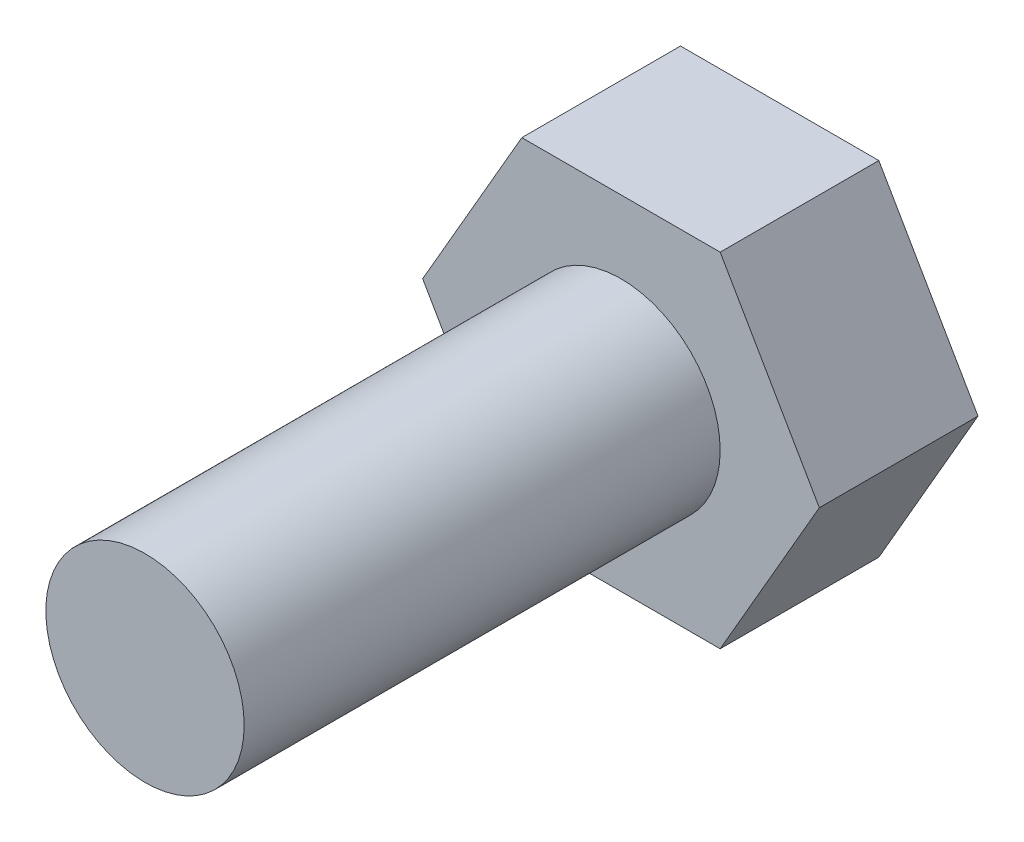
ISO-10303-21;
HEADER;
FILE_DESCRIPTION(('STEP AP214'),'2;1');
FILE_NAME('part.step','',(''),(''),'','','');
FILE_SCHEMA(('AUTOMOTIVE_DESIGN { 1 0 10303 214 1 1 1 1 }'));
ENDSEC;
DATA;
#1=APPLICATION_CONTEXT('core data for automotive mechanical design processes');
#2=APPLICATION_PROTOCOL_DEFINITION('international standard','automotive_design',2000,#1);
#3=PRODUCT_CONTEXT('',#1,'mechanical');
#4=PRODUCT('Part','Part','',(#3));
#5=PRODUCT_RELATED_PRODUCT_CATEGORY('part','',(#4));
#6=PRODUCT_DEFINITION_FORMATION('','',#4);
#7=PRODUCT_DEFINITION_CONTEXT('part definition',#1,'design');
#8=PRODUCT_DEFINITION('design','',#6,#7);
#9=PRODUCT_DEFINITION_SHAPE('','',#8);
#10=(LENGTH_UNIT() NAMED_UNIT(*) SI_UNIT(.MILLI.,.METRE.));
#11=(NAMED_UNIT(*) PLANE_ANGLE_UNIT() SI_UNIT($,.RADIAN.));
#12=(NAMED_UNIT(*) SI_UNIT($,.STERADIAN.) SOLID_ANGLE_UNIT());
#13=UNCERTAINTY_MEASURE_WITH_UNIT(LENGTH_MEASURE(1.E-05),#10,'distance_accuracy_value','');
#14=(GEOMETRIC_REPRESENTATION_CONTEXT(3) GLOBAL_UNCERTAINTY_ASSIGNED_CONTEXT((#13)) GLOBAL_UNIT_ASSIGNED_CONTEXT((#10,
#11,#12)) REPRESENTATION_CONTEXT('',''));
#15=CARTESIAN_POINT('',(0.,0.,0.));
#16=DIRECTION('',(0.,0.,1.));
#17=DIRECTION('',(1.,0.,0.));
#18=AXIS2_PLACEMENT_3D('',#15,#16,#17);
#19=CARTESIAN_POINT('',(0.,0.,12.));
#20=DIRECTION('',(0.,0.,-1.));
#21=DIRECTION('',(-1.,0.,0.));
#22=AXIS2_PLACEMENT_3D('',#19,#20,#21);
#23=CYLINDRICAL_SURFACE('',#22,2.5);
#24=CARTESIAN_POINT('',(0.,0.,12.));
#25=DIRECTION('',(0.,0.,1.));
#26=DIRECTION('',(1.,0.,0.));
#27=AXIS2_PLACEMENT_3D('',#24,#25,#26);
#28=CIRCLE('',#27,2.5);
#29=CARTESIAN_POINT('',(2.5,0.,12.));
#30=VERTEX_POINT('',#29);
#31=EDGE_CURVE('E11',#30,#30,#28,.T.);
#32=ORIENTED_EDGE('',*,*,#31,.F.);
#33=EDGE_LOOP('',(#32));
#34=FACE_BOUND('',#33,.T.);
#35=CARTESIAN_POINT('',(0.,0.,0.));
#36=DIRECTION('',(0.,0.,1.));
#37=DIRECTION('',(1.,0.,0.));
#38=AXIS2_PLACEMENT_3D('',#35,#36,#37);
#39=CIRCLE('',#38,2.5);
#40=CARTESIAN_POINT('',(2.5,0.,0.));
#41=VERTEX_POINT('',#40);
#42=EDGE_CURVE('E35',#41,#41,#39,.T.);
#43=ORIENTED_EDGE('',*,*,#42,.T.);
#44=EDGE_LOOP('',(#43));
#45=FACE_BOUND('',#44,.T.);
#46=ADVANCED_FACE('F32',(#34,#45),#23,.T.);
#47=CARTESIAN_POINT('',(0.,0.,12.));
#48=DIRECTION('',(0.,0.,1.));
#49=DIRECTION('',(1.,0.,0.));
#50=AXIS2_PLACEMENT_3D('',#47,#48,#49);
#51=PLANE('',#50);
#52=ORIENTED_EDGE('',*,*,#31,.T.);
#53=EDGE_LOOP('',(#52));
#54=FACE_BOUND('',#53,.T.);
#55=ADVANCED_FACE('F159',(#54),#51,.T.);
#56=CARTESIAN_POINT('',(-2.5,-4.3301270189222,-4.));
#57=DIRECTION('',(0.866025403784439,0.499999999999999,0.));
#58=DIRECTION('',(-0.499999999999999,0.866025403784439,0.));
#59=AXIS2_PLACEMENT_3D('',#56,#57,#58);
#60=PLANE('',#59);
#61=DIRECTION('',(-0.5,0.866025403784439,0.));
#62=VECTOR('',#61,1.);
#63=CARTESIAN_POINT('',(-2.5,-4.3301270189222,0.));
#64=LINE('',#63,#62);
#65=CARTESIAN_POINT('',(-2.5,-4.3301270189222,0.));
#66=VERTEX_POINT('',#65);
#67=CARTESIAN_POINT('',(-5.,0.,0.));
#68=VERTEX_POINT('',#67);
#69=EDGE_CURVE('E117',#66,#68,#64,.T.);
#70=ORIENTED_EDGE('',*,*,#69,.T.);
#71=DIRECTION('',(0.,0.,1.));
#72=VECTOR('',#71,1.);
#73=CARTESIAN_POINT('',(-5.,0.,-4.));
#74=LINE('',#73,#72);
#75=CARTESIAN_POINT('',(-5.,0.,-4.));
#76=VERTEX_POINT('',#75);
#77=EDGE_CURVE('E134',#76,#68,#74,.T.);
#78=ORIENTED_EDGE('',*,*,#77,.F.);
#79=DIRECTION('',(-0.5,0.866025403784439,0.));
#80=VECTOR('',#79,1.);
#81=CARTESIAN_POINT('',(-2.5,-4.3301270189222,-4.));
#82=LINE('',#81,#80);
#83=CARTESIAN_POINT('',(-2.5,-4.3301270189222,-4.));
#84=VERTEX_POINT('',#83);
#85=EDGE_CURVE('E127',#84,#76,#82,.T.);
#86=ORIENTED_EDGE('',*,*,#85,.F.);
#87=DIRECTION('',(0.,0.,1.));
#88=VECTOR('',#87,1.);
#89=CARTESIAN_POINT('',(-2.5,-4.3301270189222,-4.));
#90=LINE('',#89,#88);
#91=EDGE_CURVE('E113',#84,#66,#90,.T.);
#92=ORIENTED_EDGE('',*,*,#91,.T.);
#93=EDGE_LOOP('',(#70,#78,#86,#92));
#94=FACE_BOUND('',#93,.T.);
#95=ADVANCED_FACE('F147',(#94),#60,.F.);
#96=CARTESIAN_POINT('',(-5.,0.,-4.));
#97=DIRECTION('',(0.866025403784439,-0.5,0.));
#98=DIRECTION('',(0.5,0.866025403784439,0.));
#99=AXIS2_PLACEMENT_3D('',#96,#97,#98);
#100=PLANE('',#99);
#101=DIRECTION('',(0.5,0.866025403784439,0.));
#102=VECTOR('',#101,1.);
#103=CARTESIAN_POINT('',(-5.,0.,0.));
#104=LINE('',#103,#102);
#105=CARTESIAN_POINT('',(-2.5,4.33012701892219,0.));
#106=VERTEX_POINT('',#105);
#107=EDGE_CURVE('E120',#68,#106,#104,.T.);
#108=ORIENTED_EDGE('',*,*,#107,.T.);
#109=DIRECTION('',(0.,0.,1.));
#110=VECTOR('',#109,1.);
#111=CARTESIAN_POINT('',(-2.5,4.33012701892219,-4.));
#112=LINE('',#111,#110);
#113=CARTESIAN_POINT('',(-2.5,4.33012701892219,-4.));
#114=VERTEX_POINT('',#113);
#115=EDGE_CURVE('E131',#114,#106,#112,.T.);
#116=ORIENTED_EDGE('',*,*,#115,.F.);
#117=DIRECTION('',(0.5,0.866025403784439,0.));
#118=VECTOR('',#117,1.);
#119=CARTESIAN_POINT('',(-5.,0.,-4.));
#120=LINE('',#119,#118);
#121=EDGE_CURVE('E86',#76,#114,#120,.T.);
#122=ORIENTED_EDGE('',*,*,#121,.F.);
#123=ORIENTED_EDGE('',*,*,#77,.T.);
#124=EDGE_LOOP('',(#108,#116,#122,#123));
#125=FACE_BOUND('',#124,.T.);
#126=ADVANCED_FACE('F169',(#125),#100,.F.);
#127=CARTESIAN_POINT('',(-2.5,4.33012701892219,-4.));
#128=DIRECTION('',(0.,-1.,0.));
#129=DIRECTION('',(0.,0.,-1.));
#130=AXIS2_PLACEMENT_3D('',#127,#128,#129);
#131=PLANE('',#130);
#132=DIRECTION('',(1.,0.,0.));
#133=VECTOR('',#132,1.);
#134=CARTESIAN_POINT('',(-2.5,4.33012701892219,0.));
#135=LINE('',#134,#133);
#136=CARTESIAN_POINT('',(2.5,4.33012701892219,0.));
#137=VERTEX_POINT('',#136);
#138=EDGE_CURVE('E122',#106,#137,#135,.T.);
#139=ORIENTED_EDGE('',*,*,#138,.T.);
#140=DIRECTION('',(0.,0.,1.));
#141=VECTOR('',#140,1.);
#142=CARTESIAN_POINT('',(2.5,4.33012701892219,-4.));
#143=LINE('',#142,#141);
#144=CARTESIAN_POINT('',(2.5,4.33012701892219,-4.));
#145=VERTEX_POINT('',#144);
#146=EDGE_CURVE('E108',#145,#137,#143,.T.);
#147=ORIENTED_EDGE('',*,*,#146,.F.);
#148=DIRECTION('',(1.,0.,0.));
#149=VECTOR('',#148,1.);
#150=CARTESIAN_POINT('',(-2.5,4.33012701892219,-4.));
#151=LINE('',#150,#149);
#152=EDGE_CURVE('E99',#114,#145,#151,.T.);
#153=ORIENTED_EDGE('',*,*,#152,.F.);
#154=ORIENTED_EDGE('',*,*,#115,.T.);
#155=EDGE_LOOP('',(#139,#147,#153,#154));
#156=FACE_BOUND('',#155,.T.);
#157=ADVANCED_FACE('F174',(#156),#131,.F.);
#158=CARTESIAN_POINT('',(2.5,4.33012701892219,-4.));
#159=DIRECTION('',(-0.866025403784439,-0.5,0.));
#160=DIRECTION('',(0.5,-0.866025403784439,0.));
#161=AXIS2_PLACEMENT_3D('',#158,#159,#160);
#162=PLANE('',#161);
#163=DIRECTION('',(0.5,-0.866025403784439,0.));
#164=VECTOR('',#163,1.);
#165=CARTESIAN_POINT('',(2.5,4.33012701892219,0.));
#166=LINE('',#165,#164);
#167=CARTESIAN_POINT('',(5.,0.,0.));
#168=VERTEX_POINT('',#167);
#169=EDGE_CURVE('E107',#137,#168,#166,.T.);
#170=ORIENTED_EDGE('',*,*,#169,.T.);
#171=DIRECTION('',(0.,0.,1.));
#172=VECTOR('',#171,1.);
#173=CARTESIAN_POINT('',(5.,0.,-4.));
#174=LINE('',#173,#172);
#175=CARTESIAN_POINT('',(5.,0.,-4.));
#176=VERTEX_POINT('',#175);
#177=EDGE_CURVE('E104',#176,#168,#174,.T.);
#178=ORIENTED_EDGE('',*,*,#177,.F.);
#179=DIRECTION('',(0.5,-0.866025403784439,0.));
#180=VECTOR('',#179,1.);
#181=CARTESIAN_POINT('',(2.5,4.33012701892219,-4.));
#182=LINE('',#181,#180);
#183=EDGE_CURVE('E93',#145,#176,#182,.T.);
#184=ORIENTED_EDGE('',*,*,#183,.F.);
#185=ORIENTED_EDGE('',*,*,#146,.T.);
#186=EDGE_LOOP('',(#170,#178,#184,#185));
#187=FACE_BOUND('',#186,.T.);
#188=ADVANCED_FACE('F105',(#187),#162,.F.);
#189=CARTESIAN_POINT('',(5.,0.,-4.));
#190=DIRECTION('',(-0.866025403784439,0.5,0.));
#191=DIRECTION('',(-0.5,-0.866025403784439,0.));
#192=AXIS2_PLACEMENT_3D('',#189,#190,#191);
#193=PLANE('',#192);
#194=DIRECTION('',(-0.5,-0.866025403784439,0.));
#195=VECTOR('',#194,1.);
#196=CARTESIAN_POINT('',(5.,0.,0.));
#197=LINE('',#196,#195);
#198=CARTESIAN_POINT('',(2.5,-4.3301270189222,0.));
#199=VERTEX_POINT('',#198);
#200=EDGE_CURVE('E71',#168,#199,#197,.T.);
#201=ORIENTED_EDGE('',*,*,#200,.T.);
#202=DIRECTION('',(0.,0.,1.));
#203=VECTOR('',#202,1.);
#204=CARTESIAN_POINT('',(2.5,-4.3301270189222,-4.));
#205=LINE('',#204,#203);
#206=CARTESIAN_POINT('',(2.5,-4.3301270189222,-4.));
#207=VERTEX_POINT('',#206);
#208=EDGE_CURVE('E109',#207,#199,#205,.T.);
#209=ORIENTED_EDGE('',*,*,#208,.F.);
#210=DIRECTION('',(-0.5,-0.866025403784439,0.));
#211=VECTOR('',#210,1.);
#212=CARTESIAN_POINT('',(5.,0.,-4.));
#213=LINE('',#212,#211);
#214=EDGE_CURVE('E97',#176,#207,#213,.T.);
#215=ORIENTED_EDGE('',*,*,#214,.F.);
#216=ORIENTED_EDGE('',*,*,#177,.T.);
#217=EDGE_LOOP('',(#201,#209,#215,#216));
#218=FACE_BOUND('',#217,.T.);
#219=ADVANCED_FACE('F111',(#218),#193,.F.);
#220=CARTESIAN_POINT('',(2.5,-4.3301270189222,-4.));
#221=DIRECTION('',(0.,1.,0.));
#222=DIRECTION('',(0.,0.,1.));
#223=AXIS2_PLACEMENT_3D('',#220,#221,#222);
#224=PLANE('',#223);
#225=DIRECTION('',(-1.,0.,0.));
#226=VECTOR('',#225,1.);
#227=CARTESIAN_POINT('',(2.5,-4.3301270189222,0.));
#228=LINE('',#227,#226);
#229=EDGE_CURVE('E77',#199,#66,#228,.T.);
#230=ORIENTED_EDGE('',*,*,#229,.T.);
#231=ORIENTED_EDGE('',*,*,#91,.F.);
#232=DIRECTION('',(-1.,0.,0.));
#233=VECTOR('',#232,1.);
#234=CARTESIAN_POINT('',(2.5,-4.3301270189222,-4.));
#235=LINE('',#234,#233);
#236=EDGE_CURVE('E48',#207,#84,#235,.T.);
#237=ORIENTED_EDGE('',*,*,#236,.F.);
#238=ORIENTED_EDGE('',*,*,#208,.T.);
#239=EDGE_LOOP('',(#230,#231,#237,#238));
#240=FACE_BOUND('',#239,.T.);
#241=ADVANCED_FACE('F149',(#240),#224,.F.);
#242=CARTESIAN_POINT('',(0.,0.,-4.));
#243=DIRECTION('',(0.,0.,-1.));
#244=DIRECTION('',(-1.,0.,0.));
#245=AXIS2_PLACEMENT_3D('',#242,#243,#244);
#246=PLANE('',#245);
#247=ORIENTED_EDGE('',*,*,#85,.T.);
#248=ORIENTED_EDGE('',*,*,#121,.T.);
#249=ORIENTED_EDGE('',*,*,#152,.T.);
#250=ORIENTED_EDGE('',*,*,#183,.T.);
#251=ORIENTED_EDGE('',*,*,#214,.T.);
#252=ORIENTED_EDGE('',*,*,#236,.T.);
#253=EDGE_LOOP('',(#247,#248,#249,#250,#251,#252));
#254=FACE_BOUND('',#253,.T.);
#255=ADVANCED_FACE('F95',(#254),#246,.T.);
#256=CARTESIAN_POINT('',(0.,0.,0.));
#257=DIRECTION('',(0.,0.,-1.));
#258=DIRECTION('',(-1.,0.,0.));
#259=AXIS2_PLACEMENT_3D('',#256,#257,#258);
#260=PLANE('',#259);
#261=ORIENTED_EDGE('',*,*,#42,.F.);
#262=EDGE_LOOP('',(#261));
#263=FACE_BOUND('',#262,.T.);
#264=ORIENTED_EDGE('',*,*,#69,.F.);
#265=ORIENTED_EDGE('',*,*,#229,.F.);
#266=ORIENTED_EDGE('',*,*,#200,.F.);
#267=ORIENTED_EDGE('',*,*,#169,.F.);
#268=ORIENTED_EDGE('',*,*,#138,.F.);
#269=ORIENTED_EDGE('',*,*,#107,.F.);
#270=EDGE_LOOP('',(#264,#265,#266,#267,#268,#269));
#271=FACE_BOUND('',#270,.T.);
#272=ADVANCED_FACE('F140',(#263,#271),#260,.F.);
#273=CLOSED_SHELL('',(#46,#55,#95,#126,#157,#188,#219,#241,#255,#272));
#274=MANIFOLD_SOLID_BREP('B2',#273);
#275=ADVANCED_BREP_SHAPE_REPRESENTATION('',(#18,#274),#14);
#276=SHAPE_DEFINITION_REPRESENTATION(#9,#275);
ENDSEC;
END-ISO-10303-21;
